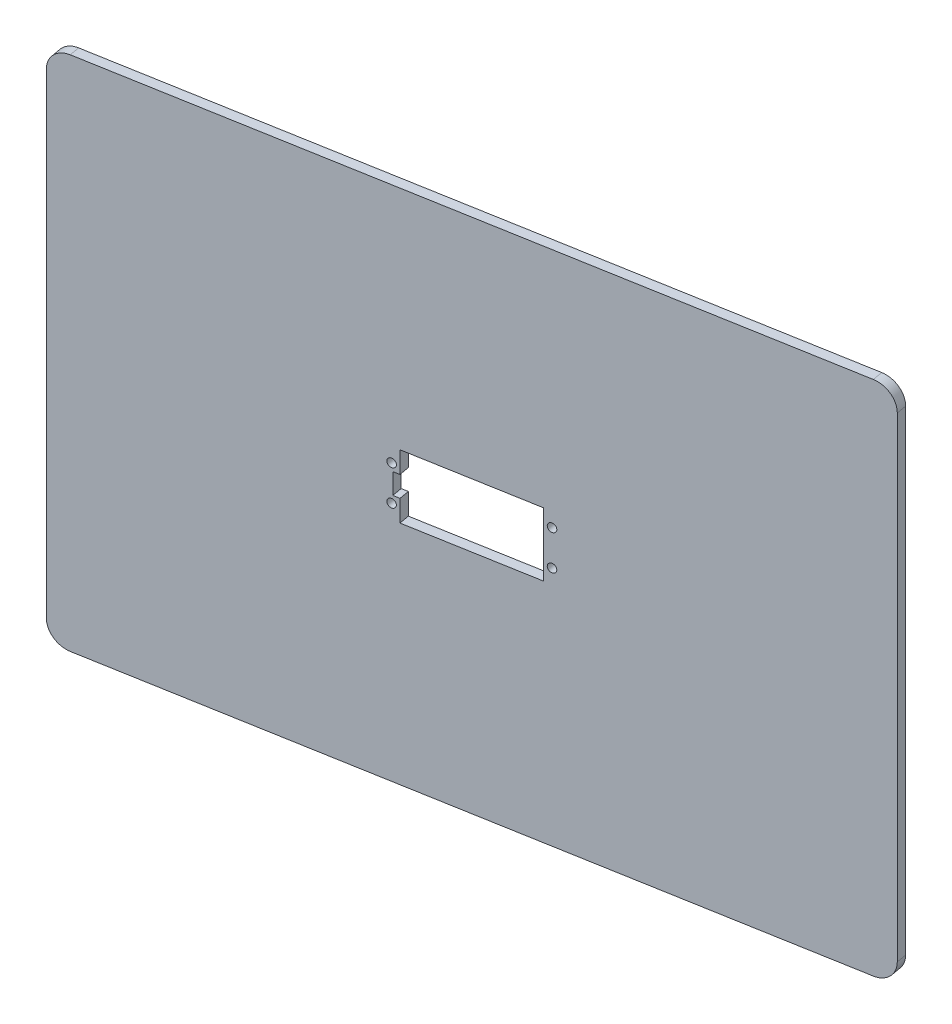
ISO-10303-21;
HEADER;
FILE_DESCRIPTION(('STEP AP214'),'2;1');
FILE_NAME('part.step','',(''),(''),'','','');
FILE_SCHEMA(('AUTOMOTIVE_DESIGN { 1 0 10303 214 1 1 1 1 }'));
ENDSEC;
DATA;
#1=APPLICATION_CONTEXT('core data for automotive mechanical design processes');
#2=APPLICATION_PROTOCOL_DEFINITION('international standard','automotive_design',2000,#1);
#3=PRODUCT_CONTEXT('',#1,'mechanical');
#4=PRODUCT('Part','Part','',(#3));
#5=PRODUCT_RELATED_PRODUCT_CATEGORY('part','',(#4));
#6=PRODUCT_DEFINITION_FORMATION('','',#4);
#7=PRODUCT_DEFINITION_CONTEXT('part definition',#1,'design');
#8=PRODUCT_DEFINITION('design','',#6,#7);
#9=PRODUCT_DEFINITION_SHAPE('','',#8);
#10=(LENGTH_UNIT() NAMED_UNIT(*) SI_UNIT(.MILLI.,.METRE.));
#11=(NAMED_UNIT(*) PLANE_ANGLE_UNIT() SI_UNIT($,.RADIAN.));
#12=(NAMED_UNIT(*) SI_UNIT($,.STERADIAN.) SOLID_ANGLE_UNIT());
#13=UNCERTAINTY_MEASURE_WITH_UNIT(LENGTH_MEASURE(1.E-05),#10,'distance_accuracy_value','');
#14=(GEOMETRIC_REPRESENTATION_CONTEXT(3) GLOBAL_UNCERTAINTY_ASSIGNED_CONTEXT((#13)) GLOBAL_UNIT_ASSIGNED_CONTEXT((#10,
#11,#12)) REPRESENTATION_CONTEXT('',''));
#15=CARTESIAN_POINT('',(0.,0.,0.));
#16=DIRECTION('',(0.,0.,1.));
#17=DIRECTION('',(1.,0.,0.));
#18=AXIS2_PLACEMENT_3D('',#15,#16,#17);
#19=CARTESIAN_POINT('',(157.64909078448,-136.228757923785,-157.662538439001));
#20=DIRECTION('',(-0.984807753012209,0.,0.173648177666924));
#21=DIRECTION('',(0.173648177666924,0.,0.984807753012209));
#22=AXIS2_PLACEMENT_3D('',#19,#20,#21);
#23=PLANE('',#22);
#24=DIRECTION('',(0.,-1.,0.));
#25=VECTOR('',#24,1.);
#26=CARTESIAN_POINT('',(158.517331672815,-136.228757923785,-152.73849967394));
#27=LINE('',#26,#25);
#28=CARTESIAN_POINT('',(158.517331672815,103.771242076215,-152.73849967394));
#29=VERTEX_POINT('',#28);
#30=CARTESIAN_POINT('',(158.517331672815,-126.228757923785,-152.73849967394));
#31=VERTEX_POINT('',#30);
#32=EDGE_CURVE('E224',#29,#31,#27,.T.);
#33=ORIENTED_EDGE('',*,*,#32,.T.);
#34=DIRECTION('',(0.173648177666924,0.,0.984807753012209));
#35=VECTOR('',#34,1.);
#36=CARTESIAN_POINT('',(157.64909078448,-126.228757923785,-157.662538439001));
#37=LINE('',#36,#35);
#38=CARTESIAN_POINT('',(157.64909078448,-126.228757923785,-157.662538439001));
#39=VERTEX_POINT('',#38);
#40=EDGE_CURVE('E11',#31,#39,#37,.F.);
#41=ORIENTED_EDGE('',*,*,#40,.T.);
#42=DIRECTION('',(0.,-1.,0.));
#43=VECTOR('',#42,1.);
#44=CARTESIAN_POINT('',(157.64909078448,-136.228757923785,-157.662538439001));
#45=LINE('',#44,#43);
#46=CARTESIAN_POINT('',(157.64909078448,103.771242076215,-157.662538439001));
#47=VERTEX_POINT('',#46);
#48=EDGE_CURVE('E225',#47,#39,#45,.T.);
#49=ORIENTED_EDGE('',*,*,#48,.F.);
#50=DIRECTION('',(0.173648177666924,0.,0.984807753012209));
#51=VECTOR('',#50,1.);
#52=CARTESIAN_POINT('',(157.64909078448,103.771242076215,-157.662538439001));
#53=LINE('',#52,#51);
#54=EDGE_CURVE('E41',#47,#29,#53,.T.);
#55=ORIENTED_EDGE('',*,*,#54,.T.);
#56=EDGE_LOOP('',(#33,#41,#49,#55));
#57=FACE_BOUND('',#56,.T.);
#58=ADVANCED_FACE('F33',(#57),#23,.F.);
#59=CARTESIAN_POINT('',(157.64909078448,-136.228757923785,-157.662538439001));
#60=DIRECTION('',(0.,1.,0.));
#61=DIRECTION('',(0.,0.,1.));
#62=AXIS2_PLACEMENT_3D('',#59,#60,#61);
#63=PLANE('',#62);
#64=DIRECTION('',(-0.984807753012209,0.,0.173648177666924));
#65=VECTOR('',#64,1.);
#66=CARTESIAN_POINT('',(158.517331672815,-136.228757923785,-152.73849967394));
#67=LINE('',#66,#65);
#68=CARTESIAN_POINT('',(148.669254142693,-136.228757923785,-151.002017897271));
#69=VERTEX_POINT('',#68);
#70=CARTESIAN_POINT('',(-181.634590797063,-136.228757923785,-92.7605382026491));
#71=VERTEX_POINT('',#70);
#72=EDGE_CURVE('E239',#69,#71,#67,.T.);
#73=ORIENTED_EDGE('',*,*,#72,.T.);
#74=DIRECTION('',(0.173648177666924,0.,0.984807753012209));
#75=VECTOR('',#74,1.);
#76=CARTESIAN_POINT('',(-182.502831685398,-136.228757923785,-97.6845769677101));
#77=LINE('',#76,#75);
#78=CARTESIAN_POINT('',(-182.502831685397,-136.228757923785,-97.6845769677101));
#79=VERTEX_POINT('',#78);
#80=EDGE_CURVE('E48',#71,#79,#77,.F.);
#81=ORIENTED_EDGE('',*,*,#80,.T.);
#82=DIRECTION('',(-0.984807753012209,0.,0.173648177666924));
#83=VECTOR('',#82,1.);
#84=CARTESIAN_POINT('',(157.64909078448,-136.228757923785,-157.662538439001));
#85=LINE('',#84,#83);
#86=CARTESIAN_POINT('',(147.801013254358,-136.228757923785,-155.926056662332));
#87=VERTEX_POINT('',#86);
#88=EDGE_CURVE('E227',#87,#79,#85,.T.);
#89=ORIENTED_EDGE('',*,*,#88,.F.);
#90=DIRECTION('',(0.173648177666924,0.,0.984807753012209));
#91=VECTOR('',#90,1.);
#92=CARTESIAN_POINT('',(147.801013254358,-136.228757923785,-155.926056662332));
#93=LINE('',#92,#91);
#94=EDGE_CURVE('E270',#87,#69,#93,.T.);
#95=ORIENTED_EDGE('',*,*,#94,.T.);
#96=EDGE_LOOP('',(#73,#81,#89,#95));
#97=FACE_BOUND('',#96,.T.);
#98=ADVANCED_FACE('F286',(#97),#63,.F.);
#99=CARTESIAN_POINT('',(-192.35090921552,-136.228757923785,-95.9480951910409));
#100=DIRECTION('',(0.984807753012209,0.,-0.173648177666924));
#101=DIRECTION('',(-0.173648177666924,0.,-0.984807753012209));
#102=AXIS2_PLACEMENT_3D('',#99,#100,#101);
#103=PLANE('',#102);
#104=DIRECTION('',(0.,1.,0.));
#105=VECTOR('',#104,1.);
#106=CARTESIAN_POINT('',(-191.482668327185,-136.228757923785,-91.0240564259798));
#107=LINE('',#106,#105);
#108=CARTESIAN_POINT('',(-191.482668327185,-126.228757923785,-91.0240564259798));
#109=VERTEX_POINT('',#108);
#110=CARTESIAN_POINT('',(-191.482668327185,103.771242076215,-91.0240564259798));
#111=VERTEX_POINT('',#110);
#112=EDGE_CURVE('E241',#109,#111,#107,.T.);
#113=ORIENTED_EDGE('',*,*,#112,.T.);
#114=DIRECTION('',(0.173648177666924,0.,0.984807753012209));
#115=VECTOR('',#114,1.);
#116=CARTESIAN_POINT('',(-192.35090921552,103.771242076215,-95.9480951910409));
#117=LINE('',#116,#115);
#118=CARTESIAN_POINT('',(-192.35090921552,103.771242076215,-95.9480951910409));
#119=VERTEX_POINT('',#118);
#120=EDGE_CURVE('E261',#111,#119,#117,.F.);
#121=ORIENTED_EDGE('',*,*,#120,.T.);
#122=DIRECTION('',(0.,1.,0.));
#123=VECTOR('',#122,1.);
#124=CARTESIAN_POINT('',(-192.35090921552,-136.228757923785,-95.9480951910409));
#125=LINE('',#124,#123);
#126=CARTESIAN_POINT('',(-192.35090921552,-126.228757923785,-95.9480951910409));
#127=VERTEX_POINT('',#126);
#128=EDGE_CURVE('E230',#127,#119,#125,.T.);
#129=ORIENTED_EDGE('',*,*,#128,.F.);
#130=DIRECTION('',(0.173648177666924,0.,0.984807753012209));
#131=VECTOR('',#130,1.);
#132=CARTESIAN_POINT('',(-192.35090921552,-126.228757923785,-95.9480951910409));
#133=LINE('',#132,#131);
#134=EDGE_CURVE('E258',#127,#109,#133,.T.);
#135=ORIENTED_EDGE('',*,*,#134,.T.);
#136=EDGE_LOOP('',(#113,#121,#129,#135));
#137=FACE_BOUND('',#136,.T.);
#138=ADVANCED_FACE('F295',(#137),#103,.F.);
#139=CARTESIAN_POINT('',(157.64909078448,113.771242076215,-157.662538439001));
#140=DIRECTION('',(0.,-1.,0.));
#141=DIRECTION('',(0.,0.,-1.));
#142=AXIS2_PLACEMENT_3D('',#139,#140,#141);
#143=PLANE('',#142);
#144=DIRECTION('',(0.984807753012209,0.,-0.173648177666924));
#145=VECTOR('',#144,1.);
#146=CARTESIAN_POINT('',(157.64909078448,113.771242076215,-157.662538439001));
#147=LINE('',#146,#145);
#148=CARTESIAN_POINT('',(-182.502831685398,113.771242076215,-97.6845769677101));
#149=VERTEX_POINT('',#148);
#150=CARTESIAN_POINT('',(147.801013254358,113.771242076215,-155.926056662332));
#151=VERTEX_POINT('',#150);
#152=EDGE_CURVE('E233',#149,#151,#147,.T.);
#153=ORIENTED_EDGE('',*,*,#152,.F.);
#154=DIRECTION('',(0.173648177666924,0.,0.984807753012209));
#155=VECTOR('',#154,1.);
#156=CARTESIAN_POINT('',(-182.502831685398,113.771242076215,-97.6845769677101));
#157=LINE('',#156,#155);
#158=CARTESIAN_POINT('',(-181.634590797063,113.771242076215,-92.7605382026491));
#159=VERTEX_POINT('',#158);
#160=EDGE_CURVE('E247',#149,#159,#157,.T.);
#161=ORIENTED_EDGE('',*,*,#160,.T.);
#162=DIRECTION('',(0.984807753012209,0.,-0.173648177666924));
#163=VECTOR('',#162,1.);
#164=CARTESIAN_POINT('',(158.517331672815,113.771242076215,-152.73849967394));
#165=LINE('',#164,#163);
#166=CARTESIAN_POINT('',(148.669254142693,113.771242076215,-151.002017897271));
#167=VERTEX_POINT('',#166);
#168=EDGE_CURVE('E228',#159,#167,#165,.T.);
#169=ORIENTED_EDGE('',*,*,#168,.T.);
#170=DIRECTION('',(0.173648177666924,0.,0.984807753012209));
#171=VECTOR('',#170,1.);
#172=CARTESIAN_POINT('',(147.801013254358,113.771242076215,-155.926056662332));
#173=LINE('',#172,#171);
#174=EDGE_CURVE('E236',#167,#151,#173,.F.);
#175=ORIENTED_EDGE('',*,*,#174,.T.);
#176=EDGE_LOOP('',(#153,#161,#169,#175));
#177=FACE_BOUND('',#176,.T.);
#178=ADVANCED_FACE('F303',(#177),#143,.F.);
#179=CARTESIAN_POINT('',(-22.2081802466491,0.,-125.948848879619));
#180=DIRECTION('',(0.173648177666924,0.,0.984807753012209));
#181=DIRECTION('',(0.984807753012209,0.,-0.173648177666924));
#182=AXIS2_PLACEMENT_3D('',#179,#180,#181);
#183=PLANE('',#182);
#184=CARTESIAN_POINT('',(15.6401505103894,-19.6787579237847,-132.622530766863));
#185=DIRECTION('',(-0.173648177666924,0.,-0.984807753012209));
#186=DIRECTION('',(-0.984807753012209,0.,0.173648177666924));
#187=AXIS2_PLACEMENT_3D('',#184,#185,#186);
#188=CIRCLE('',#187,2.);
#189=CARTESIAN_POINT('',(13.6705350043649,-19.6787579237847,-132.275234411529));
#190=VERTEX_POINT('',#189);
#191=EDGE_CURVE('E504',#190,#190,#188,.T.);
#192=ORIENTED_EDGE('',*,*,#191,.F.);
#193=EDGE_LOOP('',(#192));
#194=FACE_BOUND('',#193,.T.);
#195=CARTESIAN_POINT('',(15.6401505103894,-2.77875792378472,-132.622530766863));
#196=DIRECTION('',(-0.173648177666924,0.,-0.984807753012209));
#197=DIRECTION('',(-0.984807753012209,0.,0.173648177666924));
#198=AXIS2_PLACEMENT_3D('',#195,#196,#197);
#199=CIRCLE('',#198,2.);
#200=CARTESIAN_POINT('',(13.6705350043649,-2.77875792378472,-132.275234411529));
#201=VERTEX_POINT('',#200);
#202=EDGE_CURVE('E508',#201,#201,#199,.T.);
#203=ORIENTED_EDGE('',*,*,#202,.F.);
#204=EDGE_LOOP('',(#203));
#205=FACE_BOUND('',#204,.T.);
#206=CARTESIAN_POINT('',(-50.3419689414286,-19.6787579237847,-120.988102863179));
#207=DIRECTION('',(-0.173648177666924,0.,-0.984807753012209));
#208=DIRECTION('',(-0.984807753012209,0.,0.173648177666924));
#209=AXIS2_PLACEMENT_3D('',#206,#207,#208);
#210=CIRCLE('',#209,2.00000000000002);
#211=CARTESIAN_POINT('',(-52.3115844474531,-19.6787579237847,-120.640806507845));
#212=VERTEX_POINT('',#211);
#213=EDGE_CURVE('E512',#212,#212,#210,.T.);
#214=ORIENTED_EDGE('',*,*,#213,.F.);
#215=EDGE_LOOP('',(#214));
#216=FACE_BOUND('',#215,.T.);
#217=CARTESIAN_POINT('',(-50.3419689414286,-2.77875792378471,-120.988102863179));
#218=DIRECTION('',(-0.173648177666924,0.,-0.984807753012209));
#219=DIRECTION('',(-0.984807753012209,0.,0.173648177666924));
#220=AXIS2_PLACEMENT_3D('',#217,#218,#219);
#221=CIRCLE('',#220,2.00000000000002);
#222=CARTESIAN_POINT('',(-52.3115844474531,-2.77875792378471,-120.640806507845));
#223=VERTEX_POINT('',#222);
#224=EDGE_CURVE('E516',#223,#223,#221,.T.);
#225=ORIENTED_EDGE('',*,*,#224,.F.);
#226=EDGE_LOOP('',(#225));
#227=FACE_BOUND('',#226,.T.);
#228=DIRECTION('',(0.984807753012209,0.,-0.173648177666924));
#229=VECTOR('',#228,1.);
#230=CARTESIAN_POINT('',(-22.2081802466491,-26.5787579237847,-125.948848879619));
#231=LINE('',#230,#229);
#232=CARTESIAN_POINT('',(-46.8951418058859,-26.5787579237847,-121.595871485013));
#233=VERTEX_POINT('',#232);
#234=CARTESIAN_POINT('',(12.1933233748467,-26.5787579237847,-132.014762145029));
#235=VERTEX_POINT('',#234);
#236=EDGE_CURVE('E218',#233,#235,#231,.T.);
#237=ORIENTED_EDGE('',*,*,#236,.T.);
#238=DIRECTION('',(0.,1.,0.));
#239=VECTOR('',#238,1.);
#240=CARTESIAN_POINT('',(12.1933233748466,0.,-132.014762145029));
#241=LINE('',#240,#239);
#242=CARTESIAN_POINT('',(12.1933233748467,4.12124207621528,-132.014762145029));
#243=VERTEX_POINT('',#242);
#244=EDGE_CURVE('E221',#235,#243,#241,.T.);
#245=ORIENTED_EDGE('',*,*,#244,.T.);
#246=DIRECTION('',(-0.984807753012209,0.,0.173648177666924));
#247=VECTOR('',#246,1.);
#248=CARTESIAN_POINT('',(-22.2081802466491,4.12124207621528,-125.948848879619));
#249=LINE('',#248,#247);
#250=CARTESIAN_POINT('',(-46.8951418058859,4.12124207621528,-121.595871485013));
#251=VERTEX_POINT('',#250);
#252=EDGE_CURVE('E193',#243,#251,#249,.T.);
#253=ORIENTED_EDGE('',*,*,#252,.T.);
#254=DIRECTION('',(0.,-1.,0.));
#255=VECTOR('',#254,1.);
#256=CARTESIAN_POINT('',(-46.8951418058859,0.,-121.595871485013));
#257=LINE('',#256,#255);
#258=CARTESIAN_POINT('',(-46.8951418058859,-6.2287579237847,-121.595871485013));
#259=VERTEX_POINT('',#258);
#260=EDGE_CURVE('E155',#251,#259,#257,.T.);
#261=ORIENTED_EDGE('',*,*,#260,.T.);
#262=DIRECTION('',(-0.984807753012209,0.,0.173648177666924));
#263=VECTOR('',#262,1.);
#264=CARTESIAN_POINT('',(-22.2081802466491,-6.22875792378469,-125.948848879619));
#265=LINE('',#264,#263);
#266=CARTESIAN_POINT('',(-49.8495650649225,-6.22875792378471,-121.074926952013));
#267=VERTEX_POINT('',#266);
#268=EDGE_CURVE('E206',#259,#267,#265,.T.);
#269=ORIENTED_EDGE('',*,*,#268,.T.);
#270=DIRECTION('',(0.,-1.,0.));
#271=VECTOR('',#270,1.);
#272=CARTESIAN_POINT('',(-49.8495650649225,0.,-121.074926952013));
#273=LINE('',#272,#271);
#274=CARTESIAN_POINT('',(-49.8495650649225,-16.2287579237847,-121.074926952013));
#275=VERTEX_POINT('',#274);
#276=EDGE_CURVE('E209',#267,#275,#273,.T.);
#277=ORIENTED_EDGE('',*,*,#276,.T.);
#278=DIRECTION('',(0.984807753012209,0.,-0.173648177666924));
#279=VECTOR('',#278,1.);
#280=CARTESIAN_POINT('',(-22.2081802466491,-16.2287579237847,-125.948848879619));
#281=LINE('',#280,#279);
#282=CARTESIAN_POINT('',(-46.8951418058859,-16.2287579237847,-121.595871485013));
#283=VERTEX_POINT('',#282);
#284=EDGE_CURVE('E212',#275,#283,#281,.T.);
#285=ORIENTED_EDGE('',*,*,#284,.T.);
#286=DIRECTION('',(0.,-1.,0.));
#287=VECTOR('',#286,1.);
#288=CARTESIAN_POINT('',(-46.8951418058859,0.,-121.595871485013));
#289=LINE('',#288,#287);
#290=EDGE_CURVE('E215',#283,#233,#289,.T.);
#291=ORIENTED_EDGE('',*,*,#290,.T.);
#292=EDGE_LOOP('',(#237,#245,#253,#261,#269,#277,#285,#291));
#293=FACE_BOUND('',#292,.T.);
#294=ORIENTED_EDGE('',*,*,#128,.T.);
#295=CARTESIAN_POINT('',(-182.502831685398,103.771242076215,-97.6845769677101));
#296=DIRECTION('',(0.173648177666924,0.,0.984807753012209));
#297=DIRECTION('',(0.984807753012209,0.,-0.173648177666924));
#298=AXIS2_PLACEMENT_3D('',#295,#296,#297);
#299=CIRCLE('',#298,10.);
#300=EDGE_CURVE('E268',#119,#149,#299,.F.);
#301=ORIENTED_EDGE('',*,*,#300,.T.);
#302=ORIENTED_EDGE('',*,*,#152,.T.);
#303=CARTESIAN_POINT('',(147.801013254358,103.771242076215,-155.926056662332));
#304=DIRECTION('',(0.173648177666924,0.,0.984807753012209));
#305=DIRECTION('',(0.984807753012209,0.,-0.173648177666924));
#306=AXIS2_PLACEMENT_3D('',#303,#304,#305);
#307=CIRCLE('',#306,10.);
#308=EDGE_CURVE('E263',#151,#47,#307,.F.);
#309=ORIENTED_EDGE('',*,*,#308,.T.);
#310=ORIENTED_EDGE('',*,*,#48,.T.);
#311=CARTESIAN_POINT('',(147.801013254358,-126.228757923785,-155.926056662332));
#312=DIRECTION('',(0.173648177666924,0.,0.984807753012209));
#313=DIRECTION('',(0.984807753012209,0.,-0.173648177666924));
#314=AXIS2_PLACEMENT_3D('',#311,#312,#313);
#315=CIRCLE('',#314,10.);
#316=EDGE_CURVE('E55',#39,#87,#315,.F.);
#317=ORIENTED_EDGE('',*,*,#316,.T.);
#318=ORIENTED_EDGE('',*,*,#88,.T.);
#319=CARTESIAN_POINT('',(-182.502831685398,-126.228757923785,-97.6845769677101));
#320=DIRECTION('',(0.173648177666924,0.,0.984807753012209));
#321=DIRECTION('',(0.984807753012209,0.,-0.173648177666924));
#322=AXIS2_PLACEMENT_3D('',#319,#320,#321);
#323=CIRCLE('',#322,10.);
#324=EDGE_CURVE('E266',#79,#127,#323,.F.);
#325=ORIENTED_EDGE('',*,*,#324,.T.);
#326=EDGE_LOOP('',(#294,#301,#302,#309,#310,#317,#318,#325));
#327=FACE_BOUND('',#326,.T.);
#328=ADVANCED_FACE('F288',(#194,#205,#216,#227,#293,#327),#183,.F.);
#329=CARTESIAN_POINT('',(-21.3399393583145,0.,-121.024810114558));
#330=DIRECTION('',(0.173648177666924,0.,0.984807753012209));
#331=DIRECTION('',(0.984807753012209,0.,-0.173648177666924));
#332=AXIS2_PLACEMENT_3D('',#329,#330,#331);
#333=PLANE('',#332);
#334=CARTESIAN_POINT('',(16.508391398724,-19.6787579237847,-127.698492001802));
#335=DIRECTION('',(-0.173648177666924,0.,-0.984807753012209));
#336=DIRECTION('',(-0.984807753012209,0.,0.173648177666924));
#337=AXIS2_PLACEMENT_3D('',#334,#335,#336);
#338=CIRCLE('',#337,2.);
#339=CARTESIAN_POINT('',(14.5387758926996,-19.6787579237847,-127.351195646468));
#340=VERTEX_POINT('',#339);
#341=EDGE_CURVE('E534',#340,#340,#338,.T.);
#342=ORIENTED_EDGE('',*,*,#341,.T.);
#343=EDGE_LOOP('',(#342));
#344=FACE_BOUND('',#343,.T.);
#345=CARTESIAN_POINT('',(16.508391398724,-2.77875792378472,-127.698492001802));
#346=DIRECTION('',(-0.173648177666924,0.,-0.984807753012209));
#347=DIRECTION('',(-0.984807753012209,0.,0.173648177666924));
#348=AXIS2_PLACEMENT_3D('',#345,#346,#347);
#349=CIRCLE('',#348,2.);
#350=CARTESIAN_POINT('',(14.5387758926996,-2.77875792378472,-127.351195646468));
#351=VERTEX_POINT('',#350);
#352=EDGE_CURVE('E530',#351,#351,#349,.T.);
#353=ORIENTED_EDGE('',*,*,#352,.T.);
#354=EDGE_LOOP('',(#353));
#355=FACE_BOUND('',#354,.T.);
#356=CARTESIAN_POINT('',(-49.473728053094,-19.6787579237847,-116.064064098118));
#357=DIRECTION('',(-0.173648177666924,0.,-0.984807753012209));
#358=DIRECTION('',(-0.984807753012209,0.,0.173648177666924));
#359=AXIS2_PLACEMENT_3D('',#356,#357,#358);
#360=CIRCLE('',#359,2.00000000000002);
#361=CARTESIAN_POINT('',(-51.4433435591184,-19.6787579237847,-115.716767742784));
#362=VERTEX_POINT('',#361);
#363=EDGE_CURVE('E527',#362,#362,#360,.T.);
#364=ORIENTED_EDGE('',*,*,#363,.T.);
#365=EDGE_LOOP('',(#364));
#366=FACE_BOUND('',#365,.T.);
#367=CARTESIAN_POINT('',(-49.473728053094,-2.77875792378471,-116.064064098118));
#368=DIRECTION('',(-0.173648177666924,0.,-0.984807753012209));
#369=DIRECTION('',(-0.984807753012209,0.,0.173648177666924));
#370=AXIS2_PLACEMENT_3D('',#367,#368,#369);
#371=CIRCLE('',#370,2.00000000000002);
#372=CARTESIAN_POINT('',(-51.4433435591184,-2.77875792378471,-115.716767742784));
#373=VERTEX_POINT('',#372);
#374=EDGE_CURVE('E523',#373,#373,#371,.T.);
#375=ORIENTED_EDGE('',*,*,#374,.T.);
#376=EDGE_LOOP('',(#375));
#377=FACE_BOUND('',#376,.T.);
#378=DIRECTION('',(0.,1.,0.));
#379=VECTOR('',#378,1.);
#380=CARTESIAN_POINT('',(13.0615642631813,4.12124207621528,-127.090723379968));
#381=LINE('',#380,#379);
#382=CARTESIAN_POINT('',(13.0615642631813,-26.5787579237847,-127.090723379968));
#383=VERTEX_POINT('',#382);
#384=CARTESIAN_POINT('',(13.0615642631813,4.12124207621528,-127.090723379968));
#385=VERTEX_POINT('',#384);
#386=EDGE_CURVE('E168',#383,#385,#381,.T.);
#387=ORIENTED_EDGE('',*,*,#386,.F.);
#388=DIRECTION('',(0.984807753012209,0.,-0.173648177666923));
#389=VECTOR('',#388,1.);
#390=CARTESIAN_POINT('',(-46.0269009175513,-26.5787579237847,-116.671832719952));
#391=LINE('',#390,#389);
#392=CARTESIAN_POINT('',(-46.0269009175513,-26.5787579237847,-116.671832719952));
#393=VERTEX_POINT('',#392);
#394=EDGE_CURVE('E188',#393,#383,#391,.T.);
#395=ORIENTED_EDGE('',*,*,#394,.F.);
#396=DIRECTION('',(0.,-1.,0.));
#397=VECTOR('',#396,1.);
#398=CARTESIAN_POINT('',(-46.0269009175513,-16.2287579237847,-116.671832719952));
#399=LINE('',#398,#397);
#400=CARTESIAN_POINT('',(-46.0269009175513,-16.2287579237847,-116.671832719952));
#401=VERTEX_POINT('',#400);
#402=EDGE_CURVE('E185',#401,#393,#399,.T.);
#403=ORIENTED_EDGE('',*,*,#402,.F.);
#404=DIRECTION('',(0.984807753012209,0.,-0.173648177666926));
#405=VECTOR('',#404,1.);
#406=CARTESIAN_POINT('',(-46.0269009175513,-16.2287579237847,-116.671832719952));
#407=LINE('',#406,#405);
#408=CARTESIAN_POINT('',(-48.9813241765879,-16.2287579237847,-116.150888186952));
#409=VERTEX_POINT('',#408);
#410=EDGE_CURVE('E182',#409,#401,#407,.T.);
#411=ORIENTED_EDGE('',*,*,#410,.F.);
#412=DIRECTION('',(0.,-1.,0.));
#413=VECTOR('',#412,1.);
#414=CARTESIAN_POINT('',(-48.9813241765879,-6.22875792378471,-116.150888186952));
#415=LINE('',#414,#413);
#416=CARTESIAN_POINT('',(-48.9813241765879,-6.22875792378471,-116.150888186952));
#417=VERTEX_POINT('',#416);
#418=EDGE_CURVE('E176',#417,#409,#415,.T.);
#419=ORIENTED_EDGE('',*,*,#418,.F.);
#420=DIRECTION('',(-0.984807753012209,0.,0.173648177666926));
#421=VECTOR('',#420,1.);
#422=CARTESIAN_POINT('',(-46.0269009175513,-6.2287579237847,-116.671832719952));
#423=LINE('',#422,#421);
#424=CARTESIAN_POINT('',(-46.0269009175513,-6.2287579237847,-116.671832719952));
#425=VERTEX_POINT('',#424);
#426=EDGE_CURVE('E174',#425,#417,#423,.T.);
#427=ORIENTED_EDGE('',*,*,#426,.F.);
#428=DIRECTION('',(0.,-1.,0.));
#429=VECTOR('',#428,1.);
#430=CARTESIAN_POINT('',(-46.0269009175513,4.12124207621528,-116.671832719952));
#431=LINE('',#430,#429);
#432=CARTESIAN_POINT('',(-46.0269009175513,4.12124207621528,-116.671832719952));
#433=VERTEX_POINT('',#432);
#434=EDGE_CURVE('E152',#433,#425,#431,.T.);
#435=ORIENTED_EDGE('',*,*,#434,.F.);
#436=DIRECTION('',(-0.984807753012209,0.,0.173648177666924));
#437=VECTOR('',#436,1.);
#438=CARTESIAN_POINT('',(-46.0269009175513,4.12124207621528,-116.671832719952));
#439=LINE('',#438,#437);
#440=EDGE_CURVE('E163',#385,#433,#439,.T.);
#441=ORIENTED_EDGE('',*,*,#440,.F.);
#442=EDGE_LOOP('',(#387,#395,#403,#411,#419,#427,#435,#441));
#443=FACE_BOUND('',#442,.T.);
#444=ORIENTED_EDGE('',*,*,#168,.F.);
#445=CARTESIAN_POINT('',(-181.634590797063,103.771242076215,-92.7605382026491));
#446=DIRECTION('',(0.173648177666924,0.,0.984807753012209));
#447=DIRECTION('',(0.984807753012209,0.,-0.173648177666924));
#448=AXIS2_PLACEMENT_3D('',#445,#446,#447);
#449=CIRCLE('',#448,10.);
#450=EDGE_CURVE('E256',#159,#111,#449,.T.);
#451=ORIENTED_EDGE('',*,*,#450,.T.);
#452=ORIENTED_EDGE('',*,*,#112,.F.);
#453=CARTESIAN_POINT('',(-181.634590797063,-126.228757923785,-92.7605382026491));
#454=DIRECTION('',(0.173648177666924,0.,0.984807753012209));
#455=DIRECTION('',(0.984807753012209,0.,-0.173648177666924));
#456=AXIS2_PLACEMENT_3D('',#453,#454,#455);
#457=CIRCLE('',#456,10.);
#458=EDGE_CURVE('E254',#109,#71,#457,.T.);
#459=ORIENTED_EDGE('',*,*,#458,.T.);
#460=ORIENTED_EDGE('',*,*,#72,.F.);
#461=CARTESIAN_POINT('',(148.669254142693,-126.228757923785,-151.002017897271));
#462=DIRECTION('',(0.173648177666924,0.,0.984807753012209));
#463=DIRECTION('',(0.984807753012209,0.,-0.173648177666924));
#464=AXIS2_PLACEMENT_3D('',#461,#462,#463);
#465=CIRCLE('',#464,10.);
#466=EDGE_CURVE('E252',#69,#31,#465,.T.);
#467=ORIENTED_EDGE('',*,*,#466,.T.);
#468=ORIENTED_EDGE('',*,*,#32,.F.);
#469=CARTESIAN_POINT('',(148.669254142693,103.771242076215,-151.002017897271));
#470=DIRECTION('',(0.173648177666924,0.,0.984807753012209));
#471=DIRECTION('',(0.984807753012209,0.,-0.173648177666924));
#472=AXIS2_PLACEMENT_3D('',#469,#470,#471);
#473=CIRCLE('',#472,10.);
#474=EDGE_CURVE('E250',#29,#167,#473,.T.);
#475=ORIENTED_EDGE('',*,*,#474,.T.);
#476=EDGE_LOOP('',(#444,#451,#452,#459,#460,#467,#468,#475));
#477=FACE_BOUND('',#476,.T.);
#478=ADVANCED_FACE('F170',(#344,#355,#366,#377,#443,#477),#333,.T.);
#479=CARTESIAN_POINT('',(11.325082486512,4.12124207621528,-136.93880091009));
#480=DIRECTION('',(0.984807753012209,0.,-0.173648177666924));
#481=DIRECTION('',(-0.173648177666924,0.,-0.984807753012209));
#482=AXIS2_PLACEMENT_3D('',#479,#480,#481);
#483=PLANE('',#482);
#484=DIRECTION('',(0.173648177666924,0.,0.984807753012209));
#485=VECTOR('',#484,1.);
#486=CARTESIAN_POINT('',(11.325082486512,-26.5787579237847,-136.93880091009));
#487=LINE('',#486,#485);
#488=EDGE_CURVE('E191',#235,#383,#487,.T.);
#489=ORIENTED_EDGE('',*,*,#488,.T.);
#490=ORIENTED_EDGE('',*,*,#386,.T.);
#491=DIRECTION('',(0.173648177666924,0.,0.984807753012209));
#492=VECTOR('',#491,1.);
#493=CARTESIAN_POINT('',(11.325082486512,4.12124207621528,-136.93880091009));
#494=LINE('',#493,#492);
#495=EDGE_CURVE('E159',#243,#385,#494,.T.);
#496=ORIENTED_EDGE('',*,*,#495,.F.);
#497=ORIENTED_EDGE('',*,*,#244,.F.);
#498=EDGE_LOOP('',(#489,#490,#496,#497));
#499=FACE_BOUND('',#498,.T.);
#500=ADVANCED_FACE('F436',(#499),#483,.F.);
#501=CARTESIAN_POINT('',(-47.7633826942205,-26.5787579237847,-126.519910250074));
#502=DIRECTION('',(0.,-1.,0.));
#503=DIRECTION('',(0.,0.,-1.));
#504=AXIS2_PLACEMENT_3D('',#501,#502,#503);
#505=PLANE('',#504);
#506=DIRECTION('',(0.173648177666924,0.,0.984807753012209));
#507=VECTOR('',#506,1.);
#508=CARTESIAN_POINT('',(-47.7633826942205,-26.5787579237847,-126.519910250074));
#509=LINE('',#508,#507);
#510=EDGE_CURVE('E194',#233,#393,#509,.T.);
#511=ORIENTED_EDGE('',*,*,#510,.T.);
#512=ORIENTED_EDGE('',*,*,#394,.T.);
#513=ORIENTED_EDGE('',*,*,#488,.F.);
#514=ORIENTED_EDGE('',*,*,#236,.F.);
#515=EDGE_LOOP('',(#511,#512,#513,#514));
#516=FACE_BOUND('',#515,.T.);
#517=ADVANCED_FACE('F427',(#516),#505,.F.);
#518=CARTESIAN_POINT('',(-47.7633826942205,-16.2287579237847,-126.519910250074));
#519=DIRECTION('',(-0.984807753012209,0.,0.173648177666924));
#520=DIRECTION('',(0.173648177666924,0.,0.984807753012209));
#521=AXIS2_PLACEMENT_3D('',#518,#519,#520);
#522=PLANE('',#521);
#523=DIRECTION('',(0.173648177666924,0.,0.984807753012209));
#524=VECTOR('',#523,1.);
#525=CARTESIAN_POINT('',(-47.7633826942205,-16.2287579237847,-126.519910250074));
#526=LINE('',#525,#524);
#527=EDGE_CURVE('E196',#283,#401,#526,.T.);
#528=ORIENTED_EDGE('',*,*,#527,.T.);
#529=ORIENTED_EDGE('',*,*,#402,.T.);
#530=ORIENTED_EDGE('',*,*,#510,.F.);
#531=ORIENTED_EDGE('',*,*,#290,.F.);
#532=EDGE_LOOP('',(#528,#529,#530,#531));
#533=FACE_BOUND('',#532,.T.);
#534=ADVANCED_FACE('F418',(#533),#522,.F.);
#535=CARTESIAN_POINT('',(-47.7633826942205,-16.2287579237847,-126.519910250074));
#536=DIRECTION('',(0.,-1.,0.));
#537=DIRECTION('',(0.,0.,-1.));
#538=AXIS2_PLACEMENT_3D('',#535,#536,#537);
#539=PLANE('',#538);
#540=DIRECTION('',(0.173648177666924,0.,0.984807753012209));
#541=VECTOR('',#540,1.);
#542=CARTESIAN_POINT('',(-50.7178059532572,-16.2287579237847,-125.998965717074));
#543=LINE('',#542,#541);
#544=EDGE_CURVE('E198',#275,#409,#543,.T.);
#545=ORIENTED_EDGE('',*,*,#544,.T.);
#546=ORIENTED_EDGE('',*,*,#410,.T.);
#547=ORIENTED_EDGE('',*,*,#527,.F.);
#548=ORIENTED_EDGE('',*,*,#284,.F.);
#549=EDGE_LOOP('',(#545,#546,#547,#548));
#550=FACE_BOUND('',#549,.T.);
#551=ADVANCED_FACE('F409',(#550),#539,.F.);
#552=CARTESIAN_POINT('',(-50.7178059532572,-6.22875792378471,-125.998965717074));
#553=DIRECTION('',(-0.984807753012209,0.,0.173648177666924));
#554=DIRECTION('',(0.173648177666924,0.,0.984807753012209));
#555=AXIS2_PLACEMENT_3D('',#552,#553,#554);
#556=PLANE('',#555);
#557=DIRECTION('',(0.173648177666924,0.,0.984807753012209));
#558=VECTOR('',#557,1.);
#559=CARTESIAN_POINT('',(-50.7178059532572,-6.22875792378471,-125.998965717074));
#560=LINE('',#559,#558);
#561=EDGE_CURVE('E200',#267,#417,#560,.T.);
#562=ORIENTED_EDGE('',*,*,#561,.T.);
#563=ORIENTED_EDGE('',*,*,#418,.T.);
#564=ORIENTED_EDGE('',*,*,#544,.F.);
#565=ORIENTED_EDGE('',*,*,#276,.F.);
#566=EDGE_LOOP('',(#562,#563,#564,#565));
#567=FACE_BOUND('',#566,.T.);
#568=ADVANCED_FACE('F400',(#567),#556,.F.);
#569=CARTESIAN_POINT('',(-47.7633826942205,-6.2287579237847,-126.519910250074));
#570=DIRECTION('',(0.,1.,0.));
#571=DIRECTION('',(-1.,0.,0.));
#572=AXIS2_PLACEMENT_3D('',#569,#570,#571);
#573=PLANE('',#572);
#574=DIRECTION('',(0.173648177666924,0.,0.984807753012209));
#575=VECTOR('',#574,1.);
#576=CARTESIAN_POINT('',(-47.7633826942205,-6.2287579237847,-126.519910250074));
#577=LINE('',#576,#575);
#578=EDGE_CURVE('E158',#259,#425,#577,.T.);
#579=ORIENTED_EDGE('',*,*,#578,.T.);
#580=ORIENTED_EDGE('',*,*,#426,.T.);
#581=ORIENTED_EDGE('',*,*,#561,.F.);
#582=ORIENTED_EDGE('',*,*,#268,.F.);
#583=EDGE_LOOP('',(#579,#580,#581,#582));
#584=FACE_BOUND('',#583,.T.);
#585=ADVANCED_FACE('F392',(#584),#573,.F.);
#586=CARTESIAN_POINT('',(-47.7633826942205,4.12124207621528,-126.519910250074));
#587=DIRECTION('',(-0.984807753012209,0.,0.173648177666924));
#588=DIRECTION('',(0.173648177666924,0.,0.984807753012209));
#589=AXIS2_PLACEMENT_3D('',#586,#587,#588);
#590=PLANE('',#589);
#591=DIRECTION('',(0.173648177666924,0.,0.984807753012209));
#592=VECTOR('',#591,1.);
#593=CARTESIAN_POINT('',(-47.7633826942205,4.12124207621528,-126.519910250074));
#594=LINE('',#593,#592);
#595=EDGE_CURVE('E147',#251,#433,#594,.T.);
#596=ORIENTED_EDGE('',*,*,#595,.T.);
#597=ORIENTED_EDGE('',*,*,#434,.T.);
#598=ORIENTED_EDGE('',*,*,#578,.F.);
#599=ORIENTED_EDGE('',*,*,#260,.F.);
#600=EDGE_LOOP('',(#596,#597,#598,#599));
#601=FACE_BOUND('',#600,.T.);
#602=ADVANCED_FACE('F149',(#601),#590,.F.);
#603=CARTESIAN_POINT('',(-47.7633826942205,4.12124207621528,-126.519910250074));
#604=DIRECTION('',(0.,1.,0.));
#605=DIRECTION('',(0.,0.,1.));
#606=AXIS2_PLACEMENT_3D('',#603,#604,#605);
#607=PLANE('',#606);
#608=ORIENTED_EDGE('',*,*,#495,.T.);
#609=ORIENTED_EDGE('',*,*,#440,.T.);
#610=ORIENTED_EDGE('',*,*,#595,.F.);
#611=ORIENTED_EDGE('',*,*,#252,.F.);
#612=EDGE_LOOP('',(#608,#609,#610,#611));
#613=FACE_BOUND('',#612,.T.);
#614=ADVANCED_FACE('F164',(#613),#607,.F.);
#615=CARTESIAN_POINT('',(-49.473728053094,-2.77875792378471,-116.064064098118));
#616=DIRECTION('',(-0.173648177666924,0.,-0.984807753012209));
#617=DIRECTION('',(-0.984807753012209,0.,0.173648177666924));
#618=AXIS2_PLACEMENT_3D('',#615,#616,#617);
#619=CYLINDRICAL_SURFACE('',#618,2.00000000000002);
#620=ORIENTED_EDGE('',*,*,#374,.F.);
#621=EDGE_LOOP('',(#620));
#622=FACE_BOUND('',#621,.T.);
#623=ORIENTED_EDGE('',*,*,#224,.T.);
#624=EDGE_LOOP('',(#623));
#625=FACE_BOUND('',#624,.T.);
#626=ADVANCED_FACE('F368',(#622,#625),#619,.F.);
#627=CARTESIAN_POINT('',(-49.473728053094,-19.6787579237847,-116.064064098118));
#628=DIRECTION('',(-0.173648177666924,0.,-0.984807753012209));
#629=DIRECTION('',(-0.984807753012209,0.,0.173648177666924));
#630=AXIS2_PLACEMENT_3D('',#627,#628,#629);
#631=CYLINDRICAL_SURFACE('',#630,2.00000000000002);
#632=ORIENTED_EDGE('',*,*,#363,.F.);
#633=EDGE_LOOP('',(#632));
#634=FACE_BOUND('',#633,.T.);
#635=ORIENTED_EDGE('',*,*,#213,.T.);
#636=EDGE_LOOP('',(#635));
#637=FACE_BOUND('',#636,.T.);
#638=ADVANCED_FACE('F359',(#634,#637),#631,.F.);
#639=CARTESIAN_POINT('',(16.508391398724,-2.77875792378472,-127.698492001802));
#640=DIRECTION('',(-0.173648177666924,0.,-0.984807753012209));
#641=DIRECTION('',(-0.984807753012209,0.,0.173648177666924));
#642=AXIS2_PLACEMENT_3D('',#639,#640,#641);
#643=CYLINDRICAL_SURFACE('',#642,2.);
#644=ORIENTED_EDGE('',*,*,#352,.F.);
#645=EDGE_LOOP('',(#644));
#646=FACE_BOUND('',#645,.T.);
#647=ORIENTED_EDGE('',*,*,#202,.T.);
#648=EDGE_LOOP('',(#647));
#649=FACE_BOUND('',#648,.T.);
#650=ADVANCED_FACE('F350',(#646,#649),#643,.F.);
#651=CARTESIAN_POINT('',(16.508391398724,-19.6787579237847,-127.698492001802));
#652=DIRECTION('',(-0.173648177666924,0.,-0.984807753012209));
#653=DIRECTION('',(-0.984807753012209,0.,0.173648177666924));
#654=AXIS2_PLACEMENT_3D('',#651,#652,#653);
#655=CYLINDRICAL_SURFACE('',#654,2.);
#656=ORIENTED_EDGE('',*,*,#341,.F.);
#657=EDGE_LOOP('',(#656));
#658=FACE_BOUND('',#657,.T.);
#659=ORIENTED_EDGE('',*,*,#191,.T.);
#660=EDGE_LOOP('',(#659));
#661=FACE_BOUND('',#660,.T.);
#662=ADVANCED_FACE('F319',(#658,#661),#655,.F.);
#663=CARTESIAN_POINT('',(-182.502831685398,103.771242076215,-97.6845769677101));
#664=DIRECTION('',(0.173648177666924,0.,0.984807753012209));
#665=DIRECTION('',(0.984807753012209,0.,-0.173648177666924));
#666=AXIS2_PLACEMENT_3D('',#663,#664,#665);
#667=CYLINDRICAL_SURFACE('',#666,10.);
#668=ORIENTED_EDGE('',*,*,#300,.F.);
#669=ORIENTED_EDGE('',*,*,#120,.F.);
#670=ORIENTED_EDGE('',*,*,#450,.F.);
#671=ORIENTED_EDGE('',*,*,#160,.F.);
#672=EDGE_LOOP('',(#668,#669,#670,#671));
#673=FACE_BOUND('',#672,.T.);
#674=ADVANCED_FACE('F300',(#673),#667,.T.);
#675=CARTESIAN_POINT('',(-182.502831685398,-126.228757923785,-97.6845769677101));
#676=DIRECTION('',(0.173648177666924,0.,0.984807753012209));
#677=DIRECTION('',(0.984807753012209,0.,-0.173648177666924));
#678=AXIS2_PLACEMENT_3D('',#675,#676,#677);
#679=CYLINDRICAL_SURFACE('',#678,10.);
#680=ORIENTED_EDGE('',*,*,#324,.F.);
#681=ORIENTED_EDGE('',*,*,#80,.F.);
#682=ORIENTED_EDGE('',*,*,#458,.F.);
#683=ORIENTED_EDGE('',*,*,#134,.F.);
#684=EDGE_LOOP('',(#680,#681,#682,#683));
#685=FACE_BOUND('',#684,.T.);
#686=ADVANCED_FACE('F292',(#685),#679,.T.);
#687=CARTESIAN_POINT('',(147.801013254358,-126.228757923785,-155.926056662332));
#688=DIRECTION('',(0.173648177666924,0.,0.984807753012209));
#689=DIRECTION('',(0.984807753012209,0.,-0.173648177666924));
#690=AXIS2_PLACEMENT_3D('',#687,#688,#689);
#691=CYLINDRICAL_SURFACE('',#690,10.);
#692=ORIENTED_EDGE('',*,*,#316,.F.);
#693=ORIENTED_EDGE('',*,*,#40,.F.);
#694=ORIENTED_EDGE('',*,*,#466,.F.);
#695=ORIENTED_EDGE('',*,*,#94,.F.);
#696=EDGE_LOOP('',(#692,#693,#694,#695));
#697=FACE_BOUND('',#696,.T.);
#698=ADVANCED_FACE('F285',(#697),#691,.T.);
#699=CARTESIAN_POINT('',(147.801013254358,103.771242076215,-155.926056662332));
#700=DIRECTION('',(0.173648177666924,0.,0.984807753012209));
#701=DIRECTION('',(0.984807753012209,0.,-0.173648177666924));
#702=AXIS2_PLACEMENT_3D('',#699,#700,#701);
#703=CYLINDRICAL_SURFACE('',#702,10.);
#704=ORIENTED_EDGE('',*,*,#308,.F.);
#705=ORIENTED_EDGE('',*,*,#174,.F.);
#706=ORIENTED_EDGE('',*,*,#474,.F.);
#707=ORIENTED_EDGE('',*,*,#54,.F.);
#708=EDGE_LOOP('',(#704,#705,#706,#707));
#709=FACE_BOUND('',#708,.T.);
#710=ADVANCED_FACE('F35',(#709),#703,.T.);
#711=CLOSED_SHELL('',(#58,#98,#138,#178,#328,#478,#500,#517,#534,#551,#568,#585,#602,#614,#626,
#638,#650,#662,#674,#686,#698,#710));
#712=MANIFOLD_SOLID_BREP('B2',#711);
#713=ADVANCED_BREP_SHAPE_REPRESENTATION('',(#18,#712),#14);
#714=SHAPE_DEFINITION_REPRESENTATION(#9,#713);
ENDSEC;
END-ISO-10303-21;
